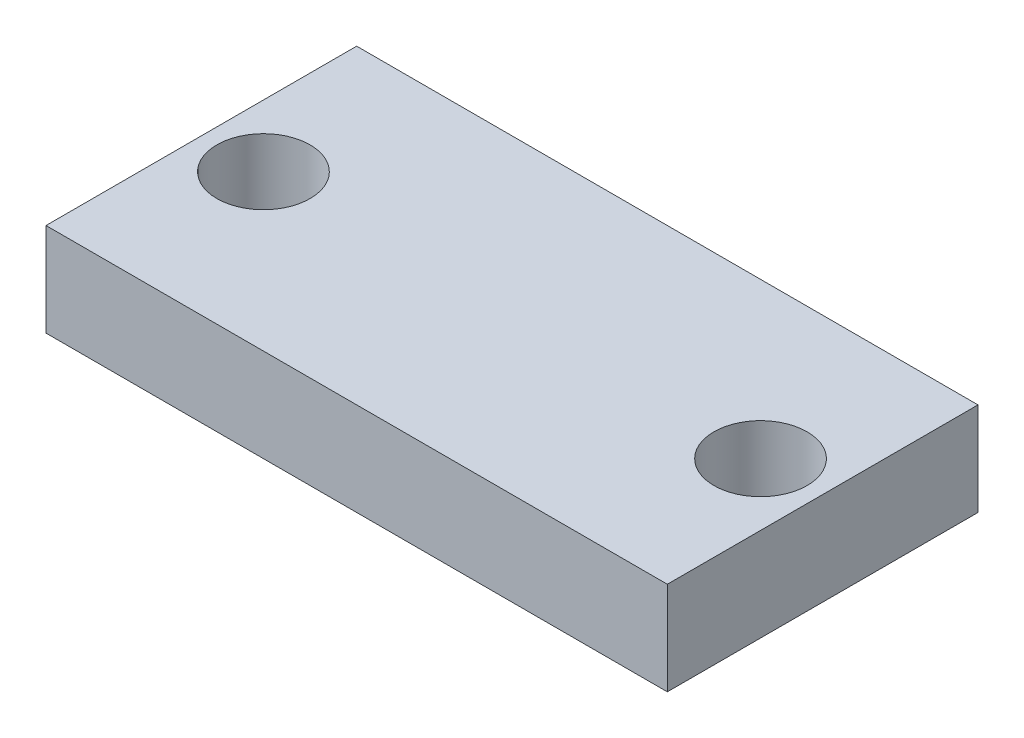
ISO-10303-21;
HEADER;
FILE_DESCRIPTION(('STEP AP214'),'2;1');
FILE_NAME('part.step','',(''),(''),'','','');
FILE_SCHEMA(('AUTOMOTIVE_DESIGN { 1 0 10303 214 1 1 1 1 }'));
ENDSEC;
DATA;
#1=APPLICATION_CONTEXT('core data for automotive mechanical design processes');
#2=APPLICATION_PROTOCOL_DEFINITION('international standard','automotive_design',2000,#1);
#3=PRODUCT_CONTEXT('',#1,'mechanical');
#4=PRODUCT('Part','Part','',(#3));
#5=PRODUCT_RELATED_PRODUCT_CATEGORY('part','',(#4));
#6=PRODUCT_DEFINITION_FORMATION('','',#4);
#7=PRODUCT_DEFINITION_CONTEXT('part definition',#1,'design');
#8=PRODUCT_DEFINITION('design','',#6,#7);
#9=PRODUCT_DEFINITION_SHAPE('','',#8);
#10=(LENGTH_UNIT() NAMED_UNIT(*) SI_UNIT(.MILLI.,.METRE.));
#11=(NAMED_UNIT(*) PLANE_ANGLE_UNIT() SI_UNIT($,.RADIAN.));
#12=(NAMED_UNIT(*) SI_UNIT($,.STERADIAN.) SOLID_ANGLE_UNIT());
#13=UNCERTAINTY_MEASURE_WITH_UNIT(LENGTH_MEASURE(1.E-05),#10,'distance_accuracy_value','');
#14=(GEOMETRIC_REPRESENTATION_CONTEXT(3) GLOBAL_UNCERTAINTY_ASSIGNED_CONTEXT((#13)) GLOBAL_UNIT_ASSIGNED_CONTEXT((#10,
#11,#12)) REPRESENTATION_CONTEXT('',''));
#15=CARTESIAN_POINT('',(0.,0.,0.));
#16=DIRECTION('',(0.,0.,1.));
#17=DIRECTION('',(1.,0.,0.));
#18=AXIS2_PLACEMENT_3D('',#15,#16,#17);
#19=CARTESIAN_POINT('',(0.,3.,0.));
#20=DIRECTION('',(0.,1.,0.));
#21=DIRECTION('',(0.,0.,1.));
#22=AXIS2_PLACEMENT_3D('',#19,#20,#21);
#23=PLANE('',#22);
#24=CARTESIAN_POINT('',(-18.,3.,-0.286885245901644));
#25=DIRECTION('',(0.,1.,0.));
#26=DIRECTION('',(0.,0.,1.));
#27=AXIS2_PLACEMENT_3D('',#24,#25,#26);
#28=CIRCLE('',#27,1.5);
#29=CARTESIAN_POINT('',(-18.,3.,1.21311475409835));
#30=VERTEX_POINT('',#29);
#31=EDGE_CURVE('E103',#30,#30,#28,.T.);
#32=ORIENTED_EDGE('',*,*,#31,.F.);
#33=EDGE_LOOP('',(#32));
#34=FACE_BOUND('',#33,.T.);
#35=DIRECTION('',(0.,0.,-1.));
#36=VECTOR('',#35,1.);
#37=CARTESIAN_POINT('',(0.,3.,4.71311475409836));
#38=LINE('',#37,#36);
#39=CARTESIAN_POINT('',(0.,3.,4.71311475409836));
#40=VERTEX_POINT('',#39);
#41=CARTESIAN_POINT('',(0.,3.,-5.28688524590164));
#42=VERTEX_POINT('',#41);
#43=EDGE_CURVE('E83',#40,#42,#38,.T.);
#44=ORIENTED_EDGE('',*,*,#43,.T.);
#45=DIRECTION('',(-1.,0.,0.));
#46=VECTOR('',#45,1.);
#47=CARTESIAN_POINT('',(0.,3.,-5.28688524590164));
#48=LINE('',#47,#46);
#49=CARTESIAN_POINT('',(-20.,3.,-5.28688524590164));
#50=VERTEX_POINT('',#49);
#51=EDGE_CURVE('E86',#42,#50,#48,.T.);
#52=ORIENTED_EDGE('',*,*,#51,.T.);
#53=DIRECTION('',(0.,0.,1.));
#54=VECTOR('',#53,1.);
#55=CARTESIAN_POINT('',(-20.,3.,-5.28688524590164));
#56=LINE('',#55,#54);
#57=CARTESIAN_POINT('',(-20.,3.,4.71311475409836));
#58=VERTEX_POINT('',#57);
#59=EDGE_CURVE('E90',#50,#58,#56,.T.);
#60=ORIENTED_EDGE('',*,*,#59,.T.);
#61=DIRECTION('',(1.,0.,0.));
#62=VECTOR('',#61,1.);
#63=CARTESIAN_POINT('',(-20.,3.,4.71311475409836));
#64=LINE('',#63,#62);
#65=EDGE_CURVE('E54',#58,#40,#64,.T.);
#66=ORIENTED_EDGE('',*,*,#65,.T.);
#67=EDGE_LOOP('',(#44,#52,#60,#66));
#68=FACE_BOUND('',#67,.T.);
#69=CARTESIAN_POINT('',(-2.,3.,-0.28688524590164));
#70=DIRECTION('',(0.,1.,0.));
#71=DIRECTION('',(0.,0.,-1.));
#72=AXIS2_PLACEMENT_3D('',#69,#70,#71);
#73=CIRCLE('',#72,1.5);
#74=CARTESIAN_POINT('',(-2.,3.,-1.78688524590164));
#75=VERTEX_POINT('',#74);
#76=EDGE_CURVE('E124',#75,#75,#73,.T.);
#77=ORIENTED_EDGE('',*,*,#76,.F.);
#78=EDGE_LOOP('',(#77));
#79=FACE_BOUND('',#78,.T.);
#80=ADVANCED_FACE('F37',(#34,#68,#79),#23,.T.);
#81=CARTESIAN_POINT('',(0.,0.,0.));
#82=DIRECTION('',(0.,1.,0.));
#83=DIRECTION('',(0.,0.,1.));
#84=AXIS2_PLACEMENT_3D('',#81,#82,#83);
#85=PLANE('',#84);
#86=DIRECTION('',(0.,0.,-1.));
#87=VECTOR('',#86,1.);
#88=CARTESIAN_POINT('',(0.,0.,0.));
#89=LINE('',#88,#87);
#90=CARTESIAN_POINT('',(0.,0.,4.71311475409836));
#91=VERTEX_POINT('',#90);
#92=CARTESIAN_POINT('',(0.,0.,-5.28688524590164));
#93=VERTEX_POINT('',#92);
#94=EDGE_CURVE('E78',#91,#93,#89,.T.);
#95=ORIENTED_EDGE('',*,*,#94,.F.);
#96=DIRECTION('',(1.,0.,0.));
#97=VECTOR('',#96,1.);
#98=CARTESIAN_POINT('',(-20.,0.,4.71311475409836));
#99=LINE('',#98,#97);
#100=CARTESIAN_POINT('',(-20.,0.,4.71311475409836));
#101=VERTEX_POINT('',#100);
#102=EDGE_CURVE('E106',#101,#91,#99,.T.);
#103=ORIENTED_EDGE('',*,*,#102,.F.);
#104=DIRECTION('',(0.,0.,1.));
#105=VECTOR('',#104,1.);
#106=CARTESIAN_POINT('',(-20.,0.,-5.28688524590164));
#107=LINE('',#106,#105);
#108=CARTESIAN_POINT('',(-20.,0.,-5.28688524590164));
#109=VERTEX_POINT('',#108);
#110=EDGE_CURVE('E71',#109,#101,#107,.T.);
#111=ORIENTED_EDGE('',*,*,#110,.F.);
#112=DIRECTION('',(-1.,0.,0.));
#113=VECTOR('',#112,1.);
#114=CARTESIAN_POINT('',(0.,0.,-5.28688524590164));
#115=LINE('',#114,#113);
#116=EDGE_CURVE('E94',#93,#109,#115,.T.);
#117=ORIENTED_EDGE('',*,*,#116,.F.);
#118=EDGE_LOOP('',(#95,#103,#111,#117));
#119=FACE_BOUND('',#118,.T.);
#120=CARTESIAN_POINT('',(-18.,0.,-0.286885245901644));
#121=DIRECTION('',(0.,1.,0.));
#122=DIRECTION('',(0.,0.,1.));
#123=AXIS2_PLACEMENT_3D('',#120,#121,#122);
#124=CIRCLE('',#123,1.5);
#125=CARTESIAN_POINT('',(-18.,0.,1.21311475409835));
#126=VERTEX_POINT('',#125);
#127=EDGE_CURVE('E119',#126,#126,#124,.T.);
#128=ORIENTED_EDGE('',*,*,#127,.T.);
#129=EDGE_LOOP('',(#128));
#130=FACE_BOUND('',#129,.T.);
#131=CARTESIAN_POINT('',(-2.,0.,-0.28688524590164));
#132=DIRECTION('',(0.,1.,0.));
#133=DIRECTION('',(0.,0.,-1.));
#134=AXIS2_PLACEMENT_3D('',#131,#132,#133);
#135=CIRCLE('',#134,1.5);
#136=CARTESIAN_POINT('',(-2.,0.,-1.78688524590164));
#137=VERTEX_POINT('',#136);
#138=EDGE_CURVE('E122',#137,#137,#135,.T.);
#139=ORIENTED_EDGE('',*,*,#138,.T.);
#140=EDGE_LOOP('',(#139));
#141=FACE_BOUND('',#140,.T.);
#142=ADVANCED_FACE('F112',(#119,#130,#141),#85,.F.);
#143=CARTESIAN_POINT('',(0.,3.,0.));
#144=DIRECTION('',(-1.,0.,0.));
#145=DIRECTION('',(0.,0.,1.));
#146=AXIS2_PLACEMENT_3D('',#143,#144,#145);
#147=PLANE('',#146);
#148=ORIENTED_EDGE('',*,*,#94,.T.);
#149=DIRECTION('',(0.,-1.,0.));
#150=VECTOR('',#149,1.);
#151=CARTESIAN_POINT('',(0.,3.,-5.28688524590164));
#152=LINE('',#151,#150);
#153=EDGE_CURVE('E11',#42,#93,#152,.T.);
#154=ORIENTED_EDGE('',*,*,#153,.F.);
#155=ORIENTED_EDGE('',*,*,#43,.F.);
#156=DIRECTION('',(0.,-1.,0.));
#157=VECTOR('',#156,1.);
#158=CARTESIAN_POINT('',(0.,3.,4.71311475409836));
#159=LINE('',#158,#157);
#160=EDGE_CURVE('E98',#40,#91,#159,.T.);
#161=ORIENTED_EDGE('',*,*,#160,.T.);
#162=EDGE_LOOP('',(#148,#154,#155,#161));
#163=FACE_BOUND('',#162,.T.);
#164=ADVANCED_FACE('F39',(#163),#147,.F.);
#165=CARTESIAN_POINT('',(0.,3.,-5.28688524590164));
#166=DIRECTION('',(0.,0.,1.));
#167=DIRECTION('',(1.,0.,0.));
#168=AXIS2_PLACEMENT_3D('',#165,#166,#167);
#169=PLANE('',#168);
#170=ORIENTED_EDGE('',*,*,#116,.T.);
#171=DIRECTION('',(0.,-1.,0.));
#172=VECTOR('',#171,1.);
#173=CARTESIAN_POINT('',(-20.,3.,-5.28688524590164));
#174=LINE('',#173,#172);
#175=EDGE_CURVE('E46',#50,#109,#174,.T.);
#176=ORIENTED_EDGE('',*,*,#175,.F.);
#177=ORIENTED_EDGE('',*,*,#51,.F.);
#178=ORIENTED_EDGE('',*,*,#153,.T.);
#179=EDGE_LOOP('',(#170,#176,#177,#178));
#180=FACE_BOUND('',#179,.T.);
#181=ADVANCED_FACE('F93',(#180),#169,.F.);
#182=CARTESIAN_POINT('',(-20.,3.,-5.28688524590164));
#183=DIRECTION('',(1.,0.,0.));
#184=DIRECTION('',(0.,0.,-1.));
#185=AXIS2_PLACEMENT_3D('',#182,#183,#184);
#186=PLANE('',#185);
#187=ORIENTED_EDGE('',*,*,#110,.T.);
#188=DIRECTION('',(0.,-1.,0.));
#189=VECTOR('',#188,1.);
#190=CARTESIAN_POINT('',(-20.,3.,4.71311475409836));
#191=LINE('',#190,#189);
#192=EDGE_CURVE('E95',#58,#101,#191,.T.);
#193=ORIENTED_EDGE('',*,*,#192,.F.);
#194=ORIENTED_EDGE('',*,*,#59,.F.);
#195=ORIENTED_EDGE('',*,*,#175,.T.);
#196=EDGE_LOOP('',(#187,#193,#194,#195));
#197=FACE_BOUND('',#196,.T.);
#198=ADVANCED_FACE('F96',(#197),#186,.F.);
#199=CARTESIAN_POINT('',(-20.,3.,4.71311475409836));
#200=DIRECTION('',(0.,0.,-1.));
#201=DIRECTION('',(-1.,0.,0.));
#202=AXIS2_PLACEMENT_3D('',#199,#200,#201);
#203=PLANE('',#202);
#204=ORIENTED_EDGE('',*,*,#102,.T.);
#205=ORIENTED_EDGE('',*,*,#160,.F.);
#206=ORIENTED_EDGE('',*,*,#65,.F.);
#207=ORIENTED_EDGE('',*,*,#192,.T.);
#208=EDGE_LOOP('',(#204,#205,#206,#207));
#209=FACE_BOUND('',#208,.T.);
#210=ADVANCED_FACE('F111',(#209),#203,.F.);
#211=CARTESIAN_POINT('',(-18.,3.,-0.286885245901644));
#212=DIRECTION('',(0.,-1.,0.));
#213=DIRECTION('',(0.,0.,-1.));
#214=AXIS2_PLACEMENT_3D('',#211,#212,#213);
#215=CYLINDRICAL_SURFACE('',#214,1.5);
#216=ORIENTED_EDGE('',*,*,#31,.T.);
#217=EDGE_LOOP('',(#216));
#218=FACE_BOUND('',#217,.T.);
#219=ORIENTED_EDGE('',*,*,#127,.F.);
#220=EDGE_LOOP('',(#219));
#221=FACE_BOUND('',#220,.T.);
#222=ADVANCED_FACE('F133',(#218,#221),#215,.F.);
#223=CARTESIAN_POINT('',(-2.,3.,-0.28688524590164));
#224=DIRECTION('',(0.,-1.,0.));
#225=DIRECTION('',(0.,0.,-1.));
#226=AXIS2_PLACEMENT_3D('',#223,#224,#225);
#227=CYLINDRICAL_SURFACE('',#226,1.5);
#228=ORIENTED_EDGE('',*,*,#76,.T.);
#229=EDGE_LOOP('',(#228));
#230=FACE_BOUND('',#229,.T.);
#231=ORIENTED_EDGE('',*,*,#138,.F.);
#232=EDGE_LOOP('',(#231));
#233=FACE_BOUND('',#232,.T.);
#234=ADVANCED_FACE('F190',(#230,#233),#227,.F.);
#235=CLOSED_SHELL('',(#80,#142,#164,#181,#198,#210,#222,#234));
#236=MANIFOLD_SOLID_BREP('B2',#235);
#237=ADVANCED_BREP_SHAPE_REPRESENTATION('',(#18,#236),#14);
#238=SHAPE_DEFINITION_REPRESENTATION(#9,#237);
ENDSEC;
END-ISO-10303-21;
